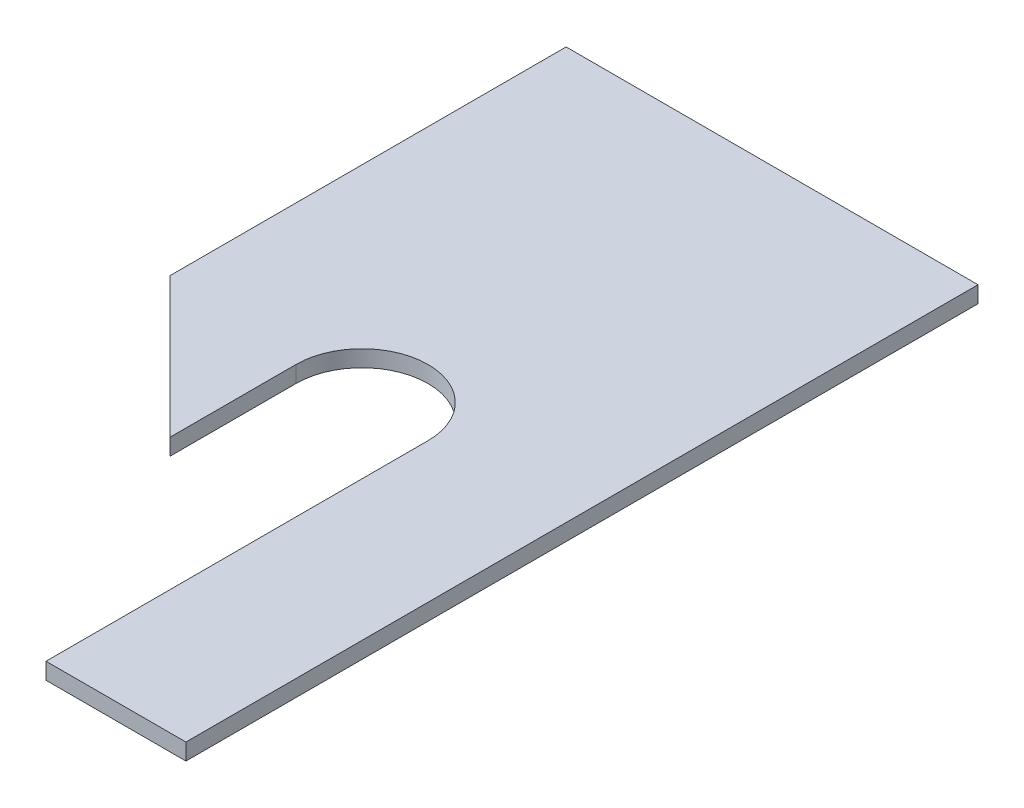
ISO-10303-21;
HEADER;
FILE_DESCRIPTION(('STEP AP214'),'2;1');
FILE_NAME('part.step','',(''),(''),'','','');
FILE_SCHEMA(('AUTOMOTIVE_DESIGN { 1 0 10303 214 1 1 1 1 }'));
ENDSEC;
DATA;
#1=APPLICATION_CONTEXT('core data for automotive mechanical design processes');
#2=APPLICATION_PROTOCOL_DEFINITION('international standard','automotive_design',2000,#1);
#3=PRODUCT_CONTEXT('',#1,'mechanical');
#4=PRODUCT('Part','Part','',(#3));
#5=PRODUCT_RELATED_PRODUCT_CATEGORY('part','',(#4));
#6=PRODUCT_DEFINITION_FORMATION('','',#4);
#7=PRODUCT_DEFINITION_CONTEXT('part definition',#1,'design');
#8=PRODUCT_DEFINITION('design','',#6,#7);
#9=PRODUCT_DEFINITION_SHAPE('','',#8);
#10=(LENGTH_UNIT() NAMED_UNIT(*) SI_UNIT(.MILLI.,.METRE.));
#11=(NAMED_UNIT(*) PLANE_ANGLE_UNIT() SI_UNIT($,.RADIAN.));
#12=(NAMED_UNIT(*) SI_UNIT($,.STERADIAN.) SOLID_ANGLE_UNIT());
#13=UNCERTAINTY_MEASURE_WITH_UNIT(LENGTH_MEASURE(1.E-05),#10,'distance_accuracy_value','');
#14=(GEOMETRIC_REPRESENTATION_CONTEXT(3) GLOBAL_UNCERTAINTY_ASSIGNED_CONTEXT((#13)) GLOBAL_UNIT_ASSIGNED_CONTEXT((#10,
#11,#12)) REPRESENTATION_CONTEXT('',''));
#15=CARTESIAN_POINT('',(0.,0.,0.));
#16=DIRECTION('',(0.,0.,1.));
#17=DIRECTION('',(1.,0.,0.));
#18=AXIS2_PLACEMENT_3D('',#15,#16,#17);
#19=CARTESIAN_POINT('',(19.812,-3.175,6.35));
#20=DIRECTION('',(1.,0.,0.));
#21=DIRECTION('',(0.,0.,-1.));
#22=AXIS2_PLACEMENT_3D('',#19,#20,#21);
#23=CYLINDRICAL_SURFACE('',#22,3.175);
#24=CARTESIAN_POINT('',(-11.90625,-3.175,3.175));
#25=CARTESIAN_POINT('',(-11.9062422889978,-3.29123774952783,3.17500738832153));
#26=CARTESIAN_POINT('',(-11.8976694959964,-3.40766564073322,3.18145090112497));
#27=CARTESIAN_POINT('',(-11.8639160647154,-3.6368615744445,3.20664508549818));
#28=CARTESIAN_POINT('',(-11.8386936724563,-3.74961966588074,3.22542669806605));
#29=CARTESIAN_POINT('',(-11.7733557491061,-3.96753495773282,3.27349366642535));
#30=CARTESIAN_POINT('',(-11.7333307452189,-4.07273381121699,3.30271513978643));
#31=CARTESIAN_POINT('',(-11.6402765305923,-4.2742204608747,3.36945991033653));
#32=CARTESIAN_POINT('',(-11.587251124023,-4.37051085250455,3.40698077864798));
#33=CARTESIAN_POINT('',(-11.464507468493,-4.56162717493788,3.49171348088459));
#34=CARTESIAN_POINT('',(-11.3936981145185,-4.65549175120323,3.53950097693389));
#35=CARTESIAN_POINT('',(-11.240300358353,-4.83080562895331,3.63907359096079));
#36=CARTESIAN_POINT('',(-11.1576937711029,-4.91223535389901,3.69086482296125));
#37=CARTESIAN_POINT('',(-10.9639370616133,-5.07741493771324,3.80569591207379));
#38=CARTESIAN_POINT('',(-10.8503979125542,-5.15827293241202,3.86888267903683));
#39=CARTESIAN_POINT('',(-10.6085465178832,-5.30005922107409,3.9892058159439));
#40=CARTESIAN_POINT('',(-10.4802547935153,-5.36101475711164,4.04635038321886));
#41=CARTESIAN_POINT('',(-10.2560392435993,-5.44322996650867,4.1278626615165));
#42=CARTESIAN_POINT('',(-10.1641422683081,-5.47093258199663,4.15674569991109));
#43=CARTESIAN_POINT('',(-9.97522653352951,-5.51530317696783,4.20415094285738));
#44=CARTESIAN_POINT('',(-9.87822005512393,-5.53199641876511,4.22269685191541));
#45=CARTESIAN_POINT('',(-9.68028514546976,-5.5532785514952,4.24650281500786));
#46=CARTESIAN_POINT('',(-9.57932931932552,-5.55775740831047,4.25164207650905));
#47=CARTESIAN_POINT('',(-9.37797382897555,-5.55384038521473,4.24720493305488));
#48=CARTESIAN_POINT('',(-9.27757437711122,-5.54543988949792,4.23762325228746));
#49=CARTESIAN_POINT('',(-9.09130873596155,-5.51811411125863,4.20738898070751));
#50=CARTESIAN_POINT('',(-9.00503601096416,-5.50040947129551,4.1880288816745));
#51=CARTESIAN_POINT('',(-8.83691578003065,-5.45632752904159,4.14156218858664));
#52=CARTESIAN_POINT('',(-8.75507261583017,-5.42994189093843,4.11444815220298));
#53=CARTESIAN_POINT('',(-8.5466929862181,-5.35039989373928,4.0363494124526));
#54=CARTESIAN_POINT('',(-8.42422683857752,-5.29082235734334,3.98104281991326));
#55=CARTESIAN_POINT('',(-8.19277551835875,-5.15331112011659,3.86503389194644));
#56=CARTESIAN_POINT('',(-8.08382409893671,-5.07533281755673,3.80431867268843));
#57=CARTESIAN_POINT('',(-7.87756649273064,-4.89984421512689,3.68217970202327));
#58=CARTESIAN_POINT('',(-7.78062228656218,-4.80189183649656,3.62077656063647));
#59=CARTESIAN_POINT('',(-7.60370646074835,-4.58854575319329,3.504437397073));
#60=CARTESIAN_POINT('',(-7.52370237668445,-4.47318614861414,3.44948909639096));
#61=CARTESIAN_POINT('',(-7.39778048116587,-4.25116955278269,3.36105934851844));
#62=CARTESIAN_POINT('',(-7.34824445654671,-4.1474070441286,3.32548276103652));
#63=CARTESIAN_POINT('',(-7.26404300239928,-3.93120907474954,3.26433014259229));
#64=CARTESIAN_POINT('',(-7.2293682593848,-3.81877909816551,3.23874784915111));
#65=CARTESIAN_POINT('',(-7.17668528591231,-3.58723601984555,3.1996762796162));
#66=CARTESIAN_POINT('',(-7.15878016404419,-3.46808628714193,3.1862618336279));
#67=CARTESIAN_POINT('',(-7.14129001606236,-3.22770696526885,3.17316034985065));
#68=CARTESIAN_POINT('',(-7.14169726049924,-3.10647827520302,3.17346752031719));
#69=CARTESIAN_POINT('',(-7.15980099862729,-2.87844831475295,3.18702455369988));
#70=CARTESIAN_POINT('',(-7.17575482973999,-2.77142208975862,3.19896984005571));
#71=CARTESIAN_POINT('',(-7.22149589833807,-2.56204927566255,3.23292282697019));
#72=CARTESIAN_POINT('',(-7.25128607934728,-2.45970368740387,3.25493266863144));
#73=CARTESIAN_POINT('',(-7.32454636788784,-2.25835099603219,3.30835255247656));
#74=CARTESIAN_POINT('',(-7.36846217086249,-2.15958919595996,3.34006693807746));
#75=CARTESIAN_POINT('',(-7.46787410268725,-1.97085133088783,3.41047462022189));
#76=CARTESIAN_POINT('',(-7.5233718335631,-1.88087648383952,3.44916888212948));
#77=CARTESIAN_POINT('',(-7.65457946600812,-1.69622750589673,3.53823130343926));
#78=CARTESIAN_POINT('',(-7.73211702451384,-1.60327791289923,3.58946985897001));
#79=CARTESIAN_POINT('',(-7.89941968956511,-1.43077348049052,3.69509065085416));
#80=CARTESIAN_POINT('',(-7.98921187198676,-1.35124919916581,3.74947969040796));
#81=CARTESIAN_POINT('',(-8.14135867762719,-1.23568014727309,3.83552984273079));
#82=CARTESIAN_POINT('',(-8.20011842432266,-1.19506041250094,3.8674845242569));
#83=CARTESIAN_POINT('',(-8.32153746131706,-1.11899083932021,3.930106097604));
#84=CARTESIAN_POINT('',(-8.38419817234931,-1.08354290038425,3.96077251334711));
#85=CARTESIAN_POINT('',(-8.57772514702997,-0.985512117393265,4.04903991166232));
#86=CARTESIAN_POINT('',(-8.71459858920488,-0.930887236326167,4.10318796138124));
#87=CARTESIAN_POINT('',(-8.9462342137088,-0.86334472180501,4.17324137950198));
#88=CARTESIAN_POINT('',(-9.03667460214931,-0.842468754109672,4.19582994116718));
#89=CARTESIAN_POINT('',(-9.22131875637091,-0.811348551938333,4.23001890762115));
#90=CARTESIAN_POINT('',(-9.31551363011133,-0.801080586191723,4.24164383416924));
#91=CARTESIAN_POINT('',(-9.5056796611505,-0.791918902243315,4.25199832679163));
#92=CARTESIAN_POINT('',(-9.6016573893939,-0.793082926460563,4.25066242879037));
#93=CARTESIAN_POINT('',(-9.79178995129163,-0.806817049422752,4.2351888171247));
#94=CARTESIAN_POINT('',(-9.88594227242896,-0.819401867041382,4.22103458351314));
#95=CARTESIAN_POINT('',(-10.0900145308797,-0.858935344953832,4.1780245795957));
#96=CARTESIAN_POINT('',(-10.1988895175399,-0.888419974971033,4.14663391408929));
#97=CARTESIAN_POINT('',(-10.4084988278193,-0.960919174660026,4.07379558552839));
#98=CARTESIAN_POINT('',(-10.509211771218,-1.00396792095367,4.03232257962974));
#99=CARTESIAN_POINT('',(-10.7355026195185,-1.11920720513196,3.92880023621188));
#100=CARTESIAN_POINT('',(-10.8575865692866,-1.19632656353304,3.86460378800867));
#101=CARTESIAN_POINT('',(-11.0857077854426,-1.3707837906493,3.73517601487474));
#102=CARTESIAN_POINT('',(-11.1917306078706,-1.46813967387988,3.66994381603552));
#103=CARTESIAN_POINT('',(-11.3868888307874,-1.68338393759943,3.54441593378731));
#104=CARTESIAN_POINT('',(-11.4758779422755,-1.80143483260463,3.48416533635787));
#105=CARTESIAN_POINT('',(-11.5930023182894,-1.99208845589539,3.40277462925502));
#106=CARTESIAN_POINT('',(-11.6293056515864,-2.05787268873465,3.3771506224806));
#107=CARTESIAN_POINT('',(-11.6959479856408,-2.19364867395731,3.32961257125289));
#108=CARTESIAN_POINT('',(-11.7262900645194,-2.26363823039306,3.30769661294754));
#109=CARTESIAN_POINT('',(-11.7916042882745,-2.43702165316802,3.26016572561181));
#110=CARTESIAN_POINT('',(-11.8233226487517,-2.54228469176272,3.23675466691393));
#111=CARTESIAN_POINT('',(-11.8719954379304,-2.75775035612656,3.20065210833702));
#112=CARTESIAN_POINT('',(-11.8889910995913,-2.86793827171599,3.18793067370395));
#113=CARTESIAN_POINT('',(-11.900859690726,-3.0115453205779,3.17904086083894));
#114=CARTESIAN_POINT('',(-11.9028785178754,-3.04417885510127,3.17752797457549));
#115=CARTESIAN_POINT('',(-11.905574866405,-3.10953655587336,3.17550642283789));
#116=CARTESIAN_POINT('',(-11.9062521718636,-3.14226073586306,3.17499791902191));
#117=CARTESIAN_POINT('',(-11.90625,-3.175,3.175));
#118=B_SPLINE_CURVE_WITH_KNOTS('',3,(#24,#25,#26,#27,#28,#29,#30,#31,#32,#33,#34,#35,#36,#37,
#38,#39,#40,#41,#42,#43,#44,#45,#46,#47,#48,#49,#50,#51,#52,#53,#54,#55,#56,#57,#58,#59,#60,#61,
#62,#63,#64,#65,#66,#67,#68,#69,#70,#71,#72,#73,#74,#75,#76,#77,#78,#79,#80,#81,#82,#83,#84,#85,
#86,#87,#88,#89,#90,#91,#92,#93,#94,#95,#96,#97,#98,#99,#100,#101,#102,#103,#104,#105,#106,#107,
#108,#109,#110,#111,#112,#113,#114,#115,#116,#117),.UNSPECIFIED.,.T.,.F.,(4,2,2,2,2,2,2,2,2,2,2,
2,2,2,2,2,2,2,2,2,2,2,2,2,2,2,2,2,2,2,2,2,2,2,2,2,2,2,2,2,2,2,2,2,2,2,4),(0.,0.348570211183117,
0.698017907084399,1.04536292954774,1.39260643317325,1.7720060971642,2.15199703593195,
2.60921525221329,3.06580498814704,3.36549235666219,3.66448964197523,3.96617170348745,
4.26796190951582,4.53750188133299,4.80730143441015,5.24588314241881,5.68553905368148,
6.13625715751718,6.58610351708733,6.94573326697642,7.30513730808448,7.66673692339951,
8.02818391290748,8.3532850938154,8.67845546794976,9.01510197680341,9.35179508189345,
9.74471606554964,10.138519680144,10.3730162315183,10.6075986920301,11.0748475643975,
11.360400167866,11.645312566215,11.931664780221,12.2183865637281,12.5677020067691,
12.9179047318732,13.3895916459373,13.8617002669824,14.3376974909728,14.5755004982781,
14.8131803903096,15.1489124669465,15.4837012109698,15.5818629176727,15.6800404224897),.UNSPECIFIED.);
#119=CARTESIAN_POINT('',(-7.14375,-3.175,3.175));
#120=VERTEX_POINT('',#119);
#121=CARTESIAN_POINT('',(-11.90625,-3.175,3.175));
#122=VERTEX_POINT('',#121);
#123=EDGE_CURVE('E151',#120,#122,#118,.T.);
#124=ORIENTED_EDGE('',*,*,#123,.F.);
#125=DIRECTION('',(-1.,0.,0.));
#126=VECTOR('',#125,1.);
#127=CARTESIAN_POINT('',(-12.7,-3.175,3.175));
#128=LINE('',#127,#126);
#129=CARTESIAN_POINT('',(7.14375,-3.175,3.175));
#130=VERTEX_POINT('',#129);
#131=EDGE_CURVE('E159',#130,#120,#128,.T.);
#132=ORIENTED_EDGE('',*,*,#131,.F.);
#133=CARTESIAN_POINT('',(7.14375,-3.175,3.175));
#134=CARTESIAN_POINT('',(7.14375771100222,-3.29123774952783,3.17500738832153));
#135=CARTESIAN_POINT('',(7.15233050400356,-3.40766564073322,3.18145090112497));
#136=CARTESIAN_POINT('',(7.18608393528457,-3.6368615744445,3.20664508549818));
#137=CARTESIAN_POINT('',(7.21130632754369,-3.74961966588074,3.22542669806605));
#138=CARTESIAN_POINT('',(7.27664425089392,-3.96753495773282,3.27349366642535));
#139=CARTESIAN_POINT('',(7.31666925478113,-4.07273381121698,3.30271513978643));
#140=CARTESIAN_POINT('',(7.40972346940774,-4.2742204608747,3.36945991033653));
#141=CARTESIAN_POINT('',(7.46274887597704,-4.37051085250454,3.40698077864798));
#142=CARTESIAN_POINT('',(7.585492531507,-4.56162717493788,3.49171348088459));
#143=CARTESIAN_POINT('',(7.65630188548147,-4.65549175120323,3.53950097693389));
#144=CARTESIAN_POINT('',(7.80969964164697,-4.83080562895331,3.63907359096079));
#145=CARTESIAN_POINT('',(7.89230622889713,-4.912235353899,3.69086482296125));
#146=CARTESIAN_POINT('',(8.08606293838669,-5.07741493771324,3.80569591207379));
#147=CARTESIAN_POINT('',(8.19960208744583,-5.15827293241202,3.86888267903683));
#148=CARTESIAN_POINT('',(8.44145348211678,-5.30005922107409,3.9892058159439));
#149=CARTESIAN_POINT('',(8.56974520648473,-5.36101475711164,4.04635038321886));
#150=CARTESIAN_POINT('',(8.79396075640066,-5.44322996650867,4.1278626615165));
#151=CARTESIAN_POINT('',(8.88585773169188,-5.47093258199663,4.1567456999111));
#152=CARTESIAN_POINT('',(9.07477346647049,-5.51530317696783,4.20415094285738));
#153=CARTESIAN_POINT('',(9.17177994487608,-5.53199641876511,4.22269685191542));
#154=CARTESIAN_POINT('',(9.36971485453025,-5.5532785514952,4.24650281500786));
#155=CARTESIAN_POINT('',(9.47067068067448,-5.55775740831047,4.25164207650905));
#156=CARTESIAN_POINT('',(9.67202617102445,-5.55384038521473,4.24720493305489));
#157=CARTESIAN_POINT('',(9.77242562288879,-5.54543988949792,4.23762325228746));
#158=CARTESIAN_POINT('',(9.95869126403846,-5.51811411125863,4.20738898070751));
#159=CARTESIAN_POINT('',(10.0449639890358,-5.50040947129551,4.1880288816745));
#160=CARTESIAN_POINT('',(10.2130842199694,-5.45632752904159,4.14156218858664));
#161=CARTESIAN_POINT('',(10.2949273841698,-5.42994189093843,4.11444815220298));
#162=CARTESIAN_POINT('',(10.5033070137819,-5.35039989373928,4.0363494124526));
#163=CARTESIAN_POINT('',(10.6257731614225,-5.29082235734334,3.98104281991326));
#164=CARTESIAN_POINT('',(10.8572244816412,-5.15331112011659,3.86503389194644));
#165=CARTESIAN_POINT('',(10.9661759010633,-5.07533281755673,3.80431867268843));
#166=CARTESIAN_POINT('',(11.1724335072694,-4.89984421512689,3.68217970202328));
#167=CARTESIAN_POINT('',(11.2693777134378,-4.80189183649656,3.62077656063647));
#168=CARTESIAN_POINT('',(11.4462935392517,-4.58854575319329,3.50443739707301));
#169=CARTESIAN_POINT('',(11.5262976233156,-4.47318614861414,3.44948909639096));
#170=CARTESIAN_POINT('',(11.6522195188341,-4.25116955278268,3.36105934851844));
#171=CARTESIAN_POINT('',(11.7017555434533,-4.14740704412859,3.32548276103652));
#172=CARTESIAN_POINT('',(11.7859569976007,-3.93120907474953,3.2643301425923));
#173=CARTESIAN_POINT('',(11.8206317406152,-3.8187790981655,3.23874784915111));
#174=CARTESIAN_POINT('',(11.8733147140877,-3.58723601984555,3.1996762796162));
#175=CARTESIAN_POINT('',(11.8912198359558,-3.46808628714193,3.1862618336279));
#176=CARTESIAN_POINT('',(11.9087099839376,-3.22770696526885,3.17316034985065));
#177=CARTESIAN_POINT('',(11.9083027395008,-3.10647827520301,3.17346752031719));
#178=CARTESIAN_POINT('',(11.8901990013727,-2.87844831475295,3.18702455369988));
#179=CARTESIAN_POINT('',(11.87424517026,-2.77142208975861,3.19896984005572));
#180=CARTESIAN_POINT('',(11.8285041016619,-2.56204927566254,3.23292282697019));
#181=CARTESIAN_POINT('',(11.7987139206527,-2.45970368740387,3.25493266863145));
#182=CARTESIAN_POINT('',(11.7254536321122,-2.25835099603219,3.30835255247656));
#183=CARTESIAN_POINT('',(11.6815378291375,-2.15958919595996,3.34006693807746));
#184=CARTESIAN_POINT('',(11.5821258973127,-1.97085133088782,3.41047462022189));
#185=CARTESIAN_POINT('',(11.5266281664369,-1.88087648383951,3.44916888212949));
#186=CARTESIAN_POINT('',(11.3954205339919,-1.69622750589672,3.53823130343927));
#187=CARTESIAN_POINT('',(11.3178829754862,-1.60327791289923,3.58946985897001));
#188=CARTESIAN_POINT('',(11.1505803104349,-1.43077348049051,3.69509065085416));
#189=CARTESIAN_POINT('',(11.0607881280132,-1.35124919916581,3.74947969040796));
#190=CARTESIAN_POINT('',(10.9086413223728,-1.23568014727309,3.8355298427308));
#191=CARTESIAN_POINT('',(10.8498815756773,-1.19506041250093,3.8674845242569));
#192=CARTESIAN_POINT('',(10.7284625386829,-1.11899083932021,3.93010609760401));
#193=CARTESIAN_POINT('',(10.6658018276507,-1.08354290038424,3.96077251334711));
#194=CARTESIAN_POINT('',(10.47227485297,-0.985512117393262,4.04903991166233));
#195=CARTESIAN_POINT('',(10.3354014107951,-0.930887236326165,4.10318796138125));
#196=CARTESIAN_POINT('',(10.1037657862912,-0.863344721805008,4.17324137950198));
#197=CARTESIAN_POINT('',(10.0133253978507,-0.842468754109671,4.19582994116718));
#198=CARTESIAN_POINT('',(9.82868124362909,-0.811348551938332,4.23001890762115));
#199=CARTESIAN_POINT('',(9.73448636988866,-0.801080586191721,4.24164383416924));
#200=CARTESIAN_POINT('',(9.54432033884949,-0.791918902243314,4.25199832679164));
#201=CARTESIAN_POINT('',(9.4483426106061,-0.793082926460562,4.25066242879037));
#202=CARTESIAN_POINT('',(9.25821004870836,-0.806817049422752,4.2351888171247));
#203=CARTESIAN_POINT('',(9.16405772757103,-0.819401867041384,4.22103458351314));
#204=CARTESIAN_POINT('',(8.95998546912029,-0.858935344953835,4.1780245795957));
#205=CARTESIAN_POINT('',(8.85111048246013,-0.888419974971036,4.14663391408929));
#206=CARTESIAN_POINT('',(8.64150117218066,-0.96091917466003,4.07379558552839));
#207=CARTESIAN_POINT('',(8.54078822878196,-1.00396792095368,4.03232257962973));
#208=CARTESIAN_POINT('',(8.31449738048151,-1.11920720513196,3.92880023621188));
#209=CARTESIAN_POINT('',(8.19241343071334,-1.19632656353305,3.86460378800866));
#210=CARTESIAN_POINT('',(7.96429221455737,-1.37078379064931,3.73517601487474));
#211=CARTESIAN_POINT('',(7.85826939212943,-1.46813967387989,3.66994381603552));
#212=CARTESIAN_POINT('',(7.66311116921256,-1.68338393759944,3.5444159337873));
#213=CARTESIAN_POINT('',(7.57412205772446,-1.80143483260464,3.48416533635786));
#214=CARTESIAN_POINT('',(7.45699768171056,-1.9920884558954,3.40277462925501));
#215=CARTESIAN_POINT('',(7.42069434841361,-2.05787268873466,3.3771506224806));
#216=CARTESIAN_POINT('',(7.35405201435923,-2.19364867395733,3.32961257125289));
#217=CARTESIAN_POINT('',(7.32370993548056,-2.26363823039308,3.30769661294754));
#218=CARTESIAN_POINT('',(7.25839571172553,-2.43702165316804,3.26016572561181));
#219=CARTESIAN_POINT('',(7.22667735124828,-2.54228469176274,3.23675466691393));
#220=CARTESIAN_POINT('',(7.17800456206957,-2.75775035612657,3.20065210833702));
#221=CARTESIAN_POINT('',(7.16100890040872,-2.867938271716,3.18793067370396));
#222=CARTESIAN_POINT('',(7.14914030927397,-3.01154532057791,3.17904086083894));
#223=CARTESIAN_POINT('',(7.14712148212465,-3.04417885510128,3.17752797457549));
#224=CARTESIAN_POINT('',(7.14442513359505,-3.10953655587336,3.17550642283789));
#225=CARTESIAN_POINT('',(7.14374782813639,-3.14226073586307,3.17499791902191));
#226=CARTESIAN_POINT('',(7.14375,-3.175,3.175));
#227=B_SPLINE_CURVE_WITH_KNOTS('',3,(#133,#134,#135,#136,#137,#138,#139,#140,#141,#142,#143,
#144,#145,#146,#147,#148,#149,#150,#151,#152,#153,#154,#155,#156,#157,#158,#159,#160,#161,#162,
#163,#164,#165,#166,#167,#168,#169,#170,#171,#172,#173,#174,#175,#176,#177,#178,#179,#180,#181,
#182,#183,#184,#185,#186,#187,#188,#189,#190,#191,#192,#193,#194,#195,#196,#197,#198,#199,#200,
#201,#202,#203,#204,#205,#206,#207,#208,#209,#210,#211,#212,#213,#214,#215,#216,#217,#218,#219,
#220,#221,#222,#223,#224,#225,#226),.UNSPECIFIED.,.T.,.F.,(4,2,2,2,2,2,2,2,2,2,2,2,2,2,2,2,2,2,
2,2,2,2,2,2,2,2,2,2,2,2,2,2,2,2,2,2,2,2,2,2,2,2,2,2,2,2,4),(0.,0.348570211183117,
0.698017907084399,1.04536292954774,1.39260643317325,1.77200609716419,2.15199703593195,
2.60921525221329,3.06580498814704,3.36549235666219,3.66448964197523,3.96617170348745,
4.26796190951583,4.537501881333,4.80730143441015,5.24588314241881,5.68553905368149,
6.13625715751718,6.58610351708734,6.94573326697642,7.30513730808448,7.66673692339951,
8.02818391290749,8.3532850938154,8.67845546794977,9.01510197680341,9.35179508189346,
9.74471606554965,10.138519680144,10.3730162315183,10.6075986920301,11.0748475643975,
11.360400167866,11.645312566215,11.931664780221,12.2183865637282,12.5677020067691,
12.9179047318732,13.3895916459373,13.8617002669824,14.3376974909728,14.5755004982781,
14.8131803903096,15.1489124669465,15.4837012109698,15.5818629176727,15.6800404224897),.UNSPECIFIED.);
#228=CARTESIAN_POINT('',(11.90625,-3.175,3.175));
#229=VERTEX_POINT('',#228);
#230=EDGE_CURVE('E11',#229,#130,#227,.T.);
#231=ORIENTED_EDGE('',*,*,#230,.F.);
#232=CARTESIAN_POINT('',(12.7,-3.175,3.175));
#233=VERTEX_POINT('',#232);
#234=EDGE_CURVE('E168',#233,#229,#128,.T.);
#235=ORIENTED_EDGE('',*,*,#234,.F.);
#236=CARTESIAN_POINT('',(15.875,-3.175,6.35));
#237=DIRECTION('',(0.707106781186548,0.,-0.707106781186547));
#238=DIRECTION('',(0.707106781186547,0.,0.707106781186547));
#239=AXIS2_PLACEMENT_3D('',#236,#237,#238);
#240=ELLIPSE('',#239,4.49012806053458,3.175);
#241=CARTESIAN_POINT('',(15.875,0.,6.35));
#242=VERTEX_POINT('',#241);
#243=EDGE_CURVE('E178',#233,#242,#240,.T.);
#244=ORIENTED_EDGE('',*,*,#243,.T.);
#245=DIRECTION('',(-1.,0.,0.));
#246=VECTOR('',#245,1.);
#247=CARTESIAN_POINT('',(12.7,0.,6.35));
#248=LINE('',#247,#246);
#249=CARTESIAN_POINT('',(-15.875,0.,6.35));
#250=VERTEX_POINT('',#249);
#251=EDGE_CURVE('E277',#250,#242,#248,.F.);
#252=ORIENTED_EDGE('',*,*,#251,.F.);
#253=CARTESIAN_POINT('',(-15.875,-3.175,6.34999999999999));
#254=DIRECTION('',(0.707106781186547,0.,0.707106781186547));
#255=DIRECTION('',(0.707106781186548,0.,-0.707106781186547));
#256=AXIS2_PLACEMENT_3D('',#253,#254,#255);
#257=ELLIPSE('',#256,4.49012806053458,3.175);
#258=CARTESIAN_POINT('',(-12.7,-3.175,3.175));
#259=VERTEX_POINT('',#258);
#260=EDGE_CURVE('E176',#259,#250,#257,.T.);
#261=ORIENTED_EDGE('',*,*,#260,.F.);
#262=EDGE_CURVE('E161',#122,#259,#128,.T.);
#263=ORIENTED_EDGE('',*,*,#262,.F.);
#264=EDGE_LOOP('',(#124,#132,#231,#235,#244,#252,#261,#263));
#265=FACE_BOUND('',#264,.T.);
#266=ADVANCED_FACE('F33',(#265),#23,.F.);
#267=CARTESIAN_POINT('',(-9.525,-3.175,0.));
#268=DIRECTION('',(0.,0.,-1.));
#269=DIRECTION('',(-1.,0.,0.));
#270=AXIS2_PLACEMENT_3D('',#267,#268,#269);
#271=CYLINDRICAL_SURFACE('',#270,1.47319999999999);
#272=CARTESIAN_POINT('',(-9.525,-3.175,0.));
#273=DIRECTION('',(0.,0.,-1.));
#274=DIRECTION('',(-1.,0.,0.));
#275=AXIS2_PLACEMENT_3D('',#272,#273,#274);
#276=CIRCLE('',#275,1.47319999999999);
#277=CARTESIAN_POINT('',(-10.9982,-3.175,0.));
#278=VERTEX_POINT('',#277);
#279=EDGE_CURVE('E311',#278,#278,#276,.T.);
#280=ORIENTED_EDGE('',*,*,#279,.T.);
#281=EDGE_LOOP('',(#280));
#282=FACE_BOUND('',#281,.T.);
#283=CARTESIAN_POINT('',(-9.525,-3.175,3.175));
#284=DIRECTION('',(0.,0.,-1.));
#285=DIRECTION('',(-1.,0.,0.));
#286=AXIS2_PLACEMENT_3D('',#283,#284,#285);
#287=CIRCLE('',#286,1.47319999999999);
#288=CARTESIAN_POINT('',(-10.9982,-3.175,3.175));
#289=VERTEX_POINT('',#288);
#290=EDGE_CURVE('E179',#289,#289,#287,.T.);
#291=ORIENTED_EDGE('',*,*,#290,.F.);
#292=EDGE_LOOP('',(#291));
#293=FACE_BOUND('',#292,.T.);
#294=ADVANCED_FACE('F319',(#282,#293),#271,.F.);
#295=CARTESIAN_POINT('',(9.525,-3.175,0.));
#296=DIRECTION('',(0.,0.,-1.));
#297=DIRECTION('',(-1.,0.,0.));
#298=AXIS2_PLACEMENT_3D('',#295,#296,#297);
#299=CYLINDRICAL_SURFACE('',#298,1.47319999999999);
#300=CARTESIAN_POINT('',(9.525,-3.175,0.));
#301=DIRECTION('',(0.,0.,-1.));
#302=DIRECTION('',(-1.,0.,0.));
#303=AXIS2_PLACEMENT_3D('',#300,#301,#302);
#304=CIRCLE('',#303,1.47319999999999);
#305=CARTESIAN_POINT('',(8.05180000000001,-3.175,0.));
#306=VERTEX_POINT('',#305);
#307=EDGE_CURVE('E301',#306,#306,#304,.T.);
#308=ORIENTED_EDGE('',*,*,#307,.T.);
#309=EDGE_LOOP('',(#308));
#310=FACE_BOUND('',#309,.T.);
#311=CARTESIAN_POINT('',(9.525,-3.175,3.175));
#312=DIRECTION('',(0.,0.,-1.));
#313=DIRECTION('',(-1.,0.,0.));
#314=AXIS2_PLACEMENT_3D('',#311,#312,#313);
#315=CIRCLE('',#314,1.47319999999999);
#316=CARTESIAN_POINT('',(8.05180000000002,-3.175,3.175));
#317=VERTEX_POINT('',#316);
#318=EDGE_CURVE('E304',#317,#317,#315,.T.);
#319=ORIENTED_EDGE('',*,*,#318,.F.);
#320=EDGE_LOOP('',(#319));
#321=FACE_BOUND('',#320,.T.);
#322=ADVANCED_FACE('F321',(#310,#321),#299,.F.);
#323=CARTESIAN_POINT('',(0.,0.,0.));
#324=DIRECTION('',(0.,1.,0.));
#325=DIRECTION('',(0.,0.,1.));
#326=AXIS2_PLACEMENT_3D('',#323,#324,#325);
#327=PLANE('',#326);
#328=DIRECTION('',(1.,0.,0.));
#329=VECTOR('',#328,1.);
#330=CARTESIAN_POINT('',(-19.812,0.,0.));
#331=LINE('',#330,#329);
#332=CARTESIAN_POINT('',(-19.812,0.,0.));
#333=VERTEX_POINT('',#332);
#334=CARTESIAN_POINT('',(-15.875,0.,0.));
#335=VERTEX_POINT('',#334);
#336=EDGE_CURVE('E181',#333,#335,#331,.T.);
#337=ORIENTED_EDGE('',*,*,#336,.T.);
#338=DIRECTION('',(0.,0.,-1.));
#339=VECTOR('',#338,1.);
#340=CARTESIAN_POINT('',(-15.875,0.,3.17500000000003));
#341=LINE('',#340,#339);
#342=EDGE_CURVE('E280',#335,#250,#341,.F.);
#343=ORIENTED_EDGE('',*,*,#342,.T.);
#344=ORIENTED_EDGE('',*,*,#251,.T.);
#345=DIRECTION('',(0.,0.,-1.));
#346=VECTOR('',#345,1.);
#347=CARTESIAN_POINT('',(15.875,0.,0.));
#348=LINE('',#347,#346);
#349=CARTESIAN_POINT('',(15.875,0.,0.));
#350=VERTEX_POINT('',#349);
#351=EDGE_CURVE('E279',#242,#350,#348,.T.);
#352=ORIENTED_EDGE('',*,*,#351,.T.);
#353=DIRECTION('',(1.,0.,0.));
#354=VECTOR('',#353,1.);
#355=CARTESIAN_POINT('',(19.812,0.,0.));
#356=LINE('',#355,#354);
#357=CARTESIAN_POINT('',(19.812,0.,0.));
#358=VERTEX_POINT('',#357);
#359=EDGE_CURVE('E199',#350,#358,#356,.T.);
#360=ORIENTED_EDGE('',*,*,#359,.T.);
#361=DIRECTION('',(0.,0.,-1.));
#362=VECTOR('',#361,1.);
#363=CARTESIAN_POINT('',(19.812,0.,0.));
#364=LINE('',#363,#362);
#365=CARTESIAN_POINT('',(19.812,0.,76.2));
#366=VERTEX_POINT('',#365);
#367=EDGE_CURVE('E247',#366,#358,#364,.T.);
#368=ORIENTED_EDGE('',*,*,#367,.F.);
#369=DIRECTION('',(-1.,0.,0.));
#370=VECTOR('',#369,1.);
#371=CARTESIAN_POINT('',(19.812,0.,76.2));
#372=LINE('',#371,#370);
#373=CARTESIAN_POINT('',(6.35,0.,76.2));
#374=VERTEX_POINT('',#373);
#375=EDGE_CURVE('E204',#366,#374,#372,.T.);
#376=ORIENTED_EDGE('',*,*,#375,.T.);
#377=DIRECTION('',(0.,0.,-1.));
#378=VECTOR('',#377,1.);
#379=CARTESIAN_POINT('',(6.35,0.,0.));
#380=LINE('',#379,#378);
#381=CARTESIAN_POINT('',(6.35,0.,39.4490062513201));
#382=VERTEX_POINT('',#381);
#383=EDGE_CURVE('E223',#374,#382,#380,.T.);
#384=ORIENTED_EDGE('',*,*,#383,.T.);
#385=CARTESIAN_POINT('',(0.,0.,39.4490062513201));
#386=DIRECTION('',(0.,1.,0.));
#387=DIRECTION('',(0.,0.,1.));
#388=AXIS2_PLACEMENT_3D('',#385,#386,#387);
#389=CIRCLE('',#388,6.35);
#390=CARTESIAN_POINT('',(-6.35,0.,39.4490062513201));
#391=VERTEX_POINT('',#390);
#392=EDGE_CURVE('E234',#382,#391,#389,.T.);
#393=ORIENTED_EDGE('',*,*,#392,.T.);
#394=DIRECTION('',(0.,0.,1.));
#395=VECTOR('',#394,1.);
#396=CARTESIAN_POINT('',(-6.35,0.,0.));
#397=LINE('',#396,#395);
#398=CARTESIAN_POINT('',(-6.35,0.,51.5619999999999));
#399=VERTEX_POINT('',#398);
#400=EDGE_CURVE('E220',#391,#399,#397,.T.);
#401=ORIENTED_EDGE('',*,*,#400,.T.);
#402=DIRECTION('',(-0.707106781186549,0.,-0.707106781186546));
#403=VECTOR('',#402,1.);
#404=CARTESIAN_POINT('',(-28.956,0.,28.9560000000001));
#405=LINE('',#404,#403);
#406=CARTESIAN_POINT('',(-19.812,0.,38.1));
#407=VERTEX_POINT('',#406);
#408=EDGE_CURVE('E229',#399,#407,#405,.T.);
#409=ORIENTED_EDGE('',*,*,#408,.T.);
#410=DIRECTION('',(0.,0.,1.));
#411=VECTOR('',#410,1.);
#412=CARTESIAN_POINT('',(-19.812,0.,0.));
#413=LINE('',#412,#411);
#414=EDGE_CURVE('E242',#333,#407,#413,.T.);
#415=ORIENTED_EDGE('',*,*,#414,.F.);
#416=EDGE_LOOP('',(#337,#343,#344,#352,#360,#368,#376,#384,#393,#401,#409,#415));
#417=FACE_BOUND('',#416,.T.);
#418=ADVANCED_FACE('F281',(#417),#327,.F.);
#419=CARTESIAN_POINT('',(-19.812,1.5875,0.));
#420=DIRECTION('',(1.,0.,0.));
#421=DIRECTION('',(0.,0.,-1.));
#422=AXIS2_PLACEMENT_3D('',#419,#420,#421);
#423=PLANE('',#422);
#424=DIRECTION('',(0.,-1.,0.));
#425=VECTOR('',#424,1.);
#426=CARTESIAN_POINT('',(-19.812,1.5875,0.));
#427=LINE('',#426,#425);
#428=CARTESIAN_POINT('',(-19.812,1.5875,0.));
#429=VERTEX_POINT('',#428);
#430=EDGE_CURVE('E251',#429,#333,#427,.T.);
#431=ORIENTED_EDGE('',*,*,#430,.T.);
#432=ORIENTED_EDGE('',*,*,#414,.T.);
#433=DIRECTION('',(0.,1.,0.));
#434=VECTOR('',#433,1.);
#435=CARTESIAN_POINT('',(-19.812,-6.35,38.1));
#436=LINE('',#435,#434);
#437=CARTESIAN_POINT('',(-19.812,1.5875,38.1));
#438=VERTEX_POINT('',#437);
#439=EDGE_CURVE('E226',#407,#438,#436,.T.);
#440=ORIENTED_EDGE('',*,*,#439,.T.);
#441=DIRECTION('',(0.,0.,1.));
#442=VECTOR('',#441,1.);
#443=CARTESIAN_POINT('',(-19.812,1.5875,0.));
#444=LINE('',#443,#442);
#445=EDGE_CURVE('E243',#429,#438,#444,.T.);
#446=ORIENTED_EDGE('',*,*,#445,.F.);
#447=EDGE_LOOP('',(#431,#432,#440,#446));
#448=FACE_BOUND('',#447,.T.);
#449=ADVANCED_FACE('F364',(#448),#423,.F.);
#450=CARTESIAN_POINT('',(19.812,1.5875,0.));
#451=DIRECTION('',(-1.,0.,0.));
#452=DIRECTION('',(0.,0.,1.));
#453=AXIS2_PLACEMENT_3D('',#450,#451,#452);
#454=PLANE('',#453);
#455=ORIENTED_EDGE('',*,*,#367,.T.);
#456=DIRECTION('',(0.,-1.,0.));
#457=VECTOR('',#456,1.);
#458=CARTESIAN_POINT('',(19.812,1.5875,0.));
#459=LINE('',#458,#457);
#460=CARTESIAN_POINT('',(19.812,1.5875,0.));
#461=VERTEX_POINT('',#460);
#462=EDGE_CURVE('E258',#461,#358,#459,.T.);
#463=ORIENTED_EDGE('',*,*,#462,.F.);
#464=DIRECTION('',(0.,0.,-1.));
#465=VECTOR('',#464,1.);
#466=CARTESIAN_POINT('',(19.812,1.5875,0.));
#467=LINE('',#466,#465);
#468=CARTESIAN_POINT('',(19.812,1.5875,76.2));
#469=VERTEX_POINT('',#468);
#470=EDGE_CURVE('E246',#469,#461,#467,.T.);
#471=ORIENTED_EDGE('',*,*,#470,.F.);
#472=DIRECTION('',(0.,1.,0.));
#473=VECTOR('',#472,1.);
#474=CARTESIAN_POINT('',(19.812,-18.507172771658,76.2));
#475=LINE('',#474,#473);
#476=EDGE_CURVE('E207',#366,#469,#475,.T.);
#477=ORIENTED_EDGE('',*,*,#476,.F.);
#478=EDGE_LOOP('',(#455,#463,#471,#477));
#479=FACE_BOUND('',#478,.T.);
#480=ADVANCED_FACE('F367',(#479),#454,.F.);
#481=CARTESIAN_POINT('',(-19.812,1.5875,0.));
#482=DIRECTION('',(0.,0.,1.));
#483=DIRECTION('',(1.,0.,0.));
#484=AXIS2_PLACEMENT_3D('',#481,#482,#483);
#485=PLANE('',#484);
#486=ORIENTED_EDGE('',*,*,#307,.F.);
#487=EDGE_LOOP('',(#486));
#488=FACE_BOUND('',#487,.T.);
#489=ORIENTED_EDGE('',*,*,#279,.F.);
#490=EDGE_LOOP('',(#489));
#491=FACE_BOUND('',#490,.T.);
#492=DIRECTION('',(1.,0.,0.));
#493=VECTOR('',#492,1.);
#494=CARTESIAN_POINT('',(19.812,-6.35,0.));
#495=LINE('',#494,#493);
#496=CARTESIAN_POINT('',(-12.7,-6.35,0.));
#497=VERTEX_POINT('',#496);
#498=CARTESIAN_POINT('',(12.7,-6.35,0.));
#499=VERTEX_POINT('',#498);
#500=EDGE_CURVE('E240',#497,#499,#495,.T.);
#501=ORIENTED_EDGE('',*,*,#500,.F.);
#502=DIRECTION('',(0.,-1.,0.));
#503=VECTOR('',#502,1.);
#504=CARTESIAN_POINT('',(-12.7,-6.35,0.));
#505=LINE('',#504,#503);
#506=CARTESIAN_POINT('',(-12.7,-3.175,0.));
#507=VERTEX_POINT('',#506);
#508=EDGE_CURVE('E186',#507,#497,#505,.T.);
#509=ORIENTED_EDGE('',*,*,#508,.F.);
#510=CARTESIAN_POINT('',(-15.875,-3.175,0.));
#511=DIRECTION('',(0.,0.,1.));
#512=DIRECTION('',(1.,0.,0.));
#513=AXIS2_PLACEMENT_3D('',#510,#511,#512);
#514=CIRCLE('',#513,3.175);
#515=EDGE_CURVE('E170',#507,#335,#514,.T.);
#516=ORIENTED_EDGE('',*,*,#515,.T.);
#517=ORIENTED_EDGE('',*,*,#336,.F.);
#518=ORIENTED_EDGE('',*,*,#430,.F.);
#519=DIRECTION('',(-1.,0.,0.));
#520=VECTOR('',#519,1.);
#521=CARTESIAN_POINT('',(-19.812,1.5875,0.));
#522=LINE('',#521,#520);
#523=EDGE_CURVE('E249',#461,#429,#522,.T.);
#524=ORIENTED_EDGE('',*,*,#523,.F.);
#525=ORIENTED_EDGE('',*,*,#462,.T.);
#526=ORIENTED_EDGE('',*,*,#359,.F.);
#527=CARTESIAN_POINT('',(15.875,-3.175,0.));
#528=DIRECTION('',(0.,0.,1.));
#529=DIRECTION('',(1.,0.,0.));
#530=AXIS2_PLACEMENT_3D('',#527,#528,#529);
#531=CIRCLE('',#530,3.175);
#532=CARTESIAN_POINT('',(12.7,-3.175,0.));
#533=VERTEX_POINT('',#532);
#534=EDGE_CURVE('E44',#350,#533,#531,.T.);
#535=ORIENTED_EDGE('',*,*,#534,.T.);
#536=DIRECTION('',(0.,1.,0.));
#537=VECTOR('',#536,1.);
#538=CARTESIAN_POINT('',(12.7,-6.35,0.));
#539=LINE('',#538,#537);
#540=EDGE_CURVE('E197',#499,#533,#539,.T.);
#541=ORIENTED_EDGE('',*,*,#540,.F.);
#542=EDGE_LOOP('',(#501,#509,#516,#517,#518,#524,#525,#526,#535,#541));
#543=FACE_BOUND('',#542,.T.);
#544=ADVANCED_FACE('F292',(#488,#491,#543),#485,.F.);
#545=CARTESIAN_POINT('',(0.,1.5875,0.));
#546=DIRECTION('',(0.,1.,0.));
#547=DIRECTION('',(0.,0.,1.));
#548=AXIS2_PLACEMENT_3D('',#545,#546,#547);
#549=PLANE('',#548);
#550=DIRECTION('',(0.,0.,1.));
#551=VECTOR('',#550,1.);
#552=CARTESIAN_POINT('',(-6.35,1.5875,39.4490062513201));
#553=LINE('',#552,#551);
#554=CARTESIAN_POINT('',(-6.35,1.5875,39.4490062513201));
#555=VERTEX_POINT('',#554);
#556=CARTESIAN_POINT('',(-6.35,1.5875,51.5619999999999));
#557=VERTEX_POINT('',#556);
#558=EDGE_CURVE('E206',#555,#557,#553,.T.);
#559=ORIENTED_EDGE('',*,*,#558,.F.);
#560=CARTESIAN_POINT('',(0.,1.5875,39.4490062513201));
#561=DIRECTION('',(0.,1.,0.));
#562=DIRECTION('',(0.,0.,1.));
#563=AXIS2_PLACEMENT_3D('',#560,#561,#562);
#564=CIRCLE('',#563,6.35);
#565=CARTESIAN_POINT('',(6.35,1.5875,39.4490062513201));
#566=VERTEX_POINT('',#565);
#567=EDGE_CURVE('E231',#566,#555,#564,.T.);
#568=ORIENTED_EDGE('',*,*,#567,.F.);
#569=DIRECTION('',(0.,0.,-1.));
#570=VECTOR('',#569,1.);
#571=CARTESIAN_POINT('',(6.35,1.5875,39.4490062513201));
#572=LINE('',#571,#570);
#573=CARTESIAN_POINT('',(6.35,1.5875,76.2));
#574=VERTEX_POINT('',#573);
#575=EDGE_CURVE('E216',#574,#566,#572,.T.);
#576=ORIENTED_EDGE('',*,*,#575,.F.);
#577=DIRECTION('',(1.,0.,0.));
#578=VECTOR('',#577,1.);
#579=CARTESIAN_POINT('',(19.812,1.5875,76.2));
#580=LINE('',#579,#578);
#581=EDGE_CURVE('E203',#574,#469,#580,.T.);
#582=ORIENTED_EDGE('',*,*,#581,.T.);
#583=ORIENTED_EDGE('',*,*,#470,.T.);
#584=ORIENTED_EDGE('',*,*,#523,.T.);
#585=ORIENTED_EDGE('',*,*,#445,.T.);
#586=DIRECTION('',(-0.707106781186549,0.,-0.707106781186546));
#587=VECTOR('',#586,1.);
#588=CARTESIAN_POINT('',(-28.956,1.5875,28.9560000000001));
#589=LINE('',#588,#587);
#590=EDGE_CURVE('E261',#557,#438,#589,.T.);
#591=ORIENTED_EDGE('',*,*,#590,.F.);
#592=EDGE_LOOP('',(#559,#568,#576,#582,#583,#584,#585,#591));
#593=FACE_BOUND('',#592,.T.);
#594=ADVANCED_FACE('F358',(#593),#549,.T.);
#595=CARTESIAN_POINT('',(19.812,-6.35,3.175));
#596=DIRECTION('',(0.,0.,-1.));
#597=DIRECTION('',(-1.,0.,0.));
#598=AXIS2_PLACEMENT_3D('',#595,#596,#597);
#599=PLANE('',#598);
#600=ORIENTED_EDGE('',*,*,#290,.T.);
#601=EDGE_LOOP('',(#600));
#602=FACE_BOUND('',#601,.T.);
#603=ORIENTED_EDGE('',*,*,#131,.T.);
#604=CARTESIAN_POINT('',(-9.525,-3.175,3.175));
#605=DIRECTION('',(0.,0.,1.));
#606=DIRECTION('',(1.,0.,0.));
#607=AXIS2_PLACEMENT_3D('',#604,#605,#606);
#608=CIRCLE('',#607,2.38125);
#609=EDGE_CURVE('E148',#120,#122,#608,.T.);
#610=ORIENTED_EDGE('',*,*,#609,.T.);
#611=ORIENTED_EDGE('',*,*,#262,.T.);
#612=DIRECTION('',(0.,-1.,0.));
#613=VECTOR('',#612,1.);
#614=CARTESIAN_POINT('',(-12.7,-6.35000000000001,3.175));
#615=LINE('',#614,#613);
#616=CARTESIAN_POINT('',(-12.7,-6.35,3.17500000000003));
#617=VERTEX_POINT('',#616);
#618=EDGE_CURVE('E191',#259,#617,#615,.T.);
#619=ORIENTED_EDGE('',*,*,#618,.T.);
#620=DIRECTION('',(-1.,0.,0.));
#621=VECTOR('',#620,1.);
#622=CARTESIAN_POINT('',(19.812,-6.35,3.175));
#623=LINE('',#622,#621);
#624=CARTESIAN_POINT('',(12.7,-6.35,3.175));
#625=VERTEX_POINT('',#624);
#626=EDGE_CURVE('E237',#625,#617,#623,.T.);
#627=ORIENTED_EDGE('',*,*,#626,.F.);
#628=DIRECTION('',(0.,1.,0.));
#629=VECTOR('',#628,1.);
#630=CARTESIAN_POINT('',(12.7,-6.35,3.175));
#631=LINE('',#630,#629);
#632=EDGE_CURVE('E201',#625,#233,#631,.T.);
#633=ORIENTED_EDGE('',*,*,#632,.T.);
#634=ORIENTED_EDGE('',*,*,#234,.T.);
#635=CARTESIAN_POINT('',(9.525,-3.175,3.175));
#636=DIRECTION('',(0.,0.,1.));
#637=DIRECTION('',(1.,0.,0.));
#638=AXIS2_PLACEMENT_3D('',#635,#636,#637);
#639=CIRCLE('',#638,2.38125);
#640=EDGE_CURVE('E162',#229,#130,#639,.T.);
#641=ORIENTED_EDGE('',*,*,#640,.T.);
#642=EDGE_LOOP('',(#603,#610,#611,#619,#627,#633,#634,#641));
#643=FACE_BOUND('',#642,.T.);
#644=ORIENTED_EDGE('',*,*,#318,.T.);
#645=EDGE_LOOP('',(#644));
#646=FACE_BOUND('',#645,.T.);
#647=ADVANCED_FACE('F165',(#602,#643,#646),#599,.F.);
#648=CARTESIAN_POINT('',(0.,-6.35,0.));
#649=DIRECTION('',(0.,-1.,0.));
#650=DIRECTION('',(0.,0.,-1.));
#651=AXIS2_PLACEMENT_3D('',#648,#649,#650);
#652=PLANE('',#651);
#653=DIRECTION('',(0.,0.,1.));
#654=VECTOR('',#653,1.);
#655=CARTESIAN_POINT('',(-12.7,-6.35,0.));
#656=LINE('',#655,#654);
#657=EDGE_CURVE('E271',#497,#617,#656,.T.);
#658=ORIENTED_EDGE('',*,*,#657,.F.);
#659=ORIENTED_EDGE('',*,*,#500,.T.);
#660=DIRECTION('',(0.,0.,-1.));
#661=VECTOR('',#660,1.);
#662=CARTESIAN_POINT('',(12.7,-6.35,0.));
#663=LINE('',#662,#661);
#664=EDGE_CURVE('E268',#625,#499,#663,.T.);
#665=ORIENTED_EDGE('',*,*,#664,.F.);
#666=ORIENTED_EDGE('',*,*,#626,.T.);
#667=EDGE_LOOP('',(#658,#659,#665,#666));
#668=FACE_BOUND('',#667,.T.);
#669=ADVANCED_FACE('F295',(#668),#652,.T.);
#670=CARTESIAN_POINT('',(0.,-6.35,39.4490062513201));
#671=DIRECTION('',(0.,1.,0.));
#672=DIRECTION('',(0.,0.,1.));
#673=AXIS2_PLACEMENT_3D('',#670,#671,#672);
#674=CYLINDRICAL_SURFACE('',#673,6.35);
#675=ORIENTED_EDGE('',*,*,#567,.T.);
#676=DIRECTION('',(0.,1.,0.));
#677=VECTOR('',#676,1.);
#678=CARTESIAN_POINT('',(-6.35,-6.35,39.4490062513201));
#679=LINE('',#678,#677);
#680=EDGE_CURVE('E218',#391,#555,#679,.T.);
#681=ORIENTED_EDGE('',*,*,#680,.F.);
#682=ORIENTED_EDGE('',*,*,#392,.F.);
#683=DIRECTION('',(0.,1.,0.));
#684=VECTOR('',#683,1.);
#685=CARTESIAN_POINT('',(6.35,-6.35,39.4490062513201));
#686=LINE('',#685,#684);
#687=EDGE_CURVE('E266',#566,#382,#686,.F.);
#688=ORIENTED_EDGE('',*,*,#687,.F.);
#689=EDGE_LOOP('',(#675,#681,#682,#688));
#690=FACE_BOUND('',#689,.T.);
#691=ADVANCED_FACE('F349',(#690),#674,.F.);
#692=CARTESIAN_POINT('',(-19.812,-6.35,38.1));
#693=DIRECTION('',(0.707106781186546,0.,-0.707106781186549));
#694=DIRECTION('',(-0.707106781186549,0.,-0.707106781186546));
#695=AXIS2_PLACEMENT_3D('',#692,#693,#694);
#696=PLANE('',#695);
#697=ORIENTED_EDGE('',*,*,#408,.F.);
#698=DIRECTION('',(0.,1.,0.));
#699=VECTOR('',#698,1.);
#700=CARTESIAN_POINT('',(-6.35,-6.35,51.5619999999999));
#701=LINE('',#700,#699);
#702=EDGE_CURVE('E263',#399,#557,#701,.T.);
#703=ORIENTED_EDGE('',*,*,#702,.T.);
#704=ORIENTED_EDGE('',*,*,#590,.T.);
#705=ORIENTED_EDGE('',*,*,#439,.F.);
#706=EDGE_LOOP('',(#697,#703,#704,#705));
#707=FACE_BOUND('',#706,.T.);
#708=ADVANCED_FACE('F345',(#707),#696,.F.);
#709=CARTESIAN_POINT('',(-6.35,-6.35,39.4490062513201));
#710=DIRECTION('',(-1.,0.,0.));
#711=DIRECTION('',(0.,0.,1.));
#712=AXIS2_PLACEMENT_3D('',#709,#710,#711);
#713=PLANE('',#712);
#714=ORIENTED_EDGE('',*,*,#680,.T.);
#715=ORIENTED_EDGE('',*,*,#558,.T.);
#716=ORIENTED_EDGE('',*,*,#702,.F.);
#717=ORIENTED_EDGE('',*,*,#400,.F.);
#718=EDGE_LOOP('',(#714,#715,#716,#717));
#719=FACE_BOUND('',#718,.T.);
#720=ADVANCED_FACE('F341',(#719),#713,.F.);
#721=CARTESIAN_POINT('',(6.35,-6.35,39.4490062513201));
#722=DIRECTION('',(1.,0.,0.));
#723=DIRECTION('',(0.,0.,-1.));
#724=AXIS2_PLACEMENT_3D('',#721,#722,#723);
#725=PLANE('',#724);
#726=ORIENTED_EDGE('',*,*,#383,.F.);
#727=DIRECTION('',(0.,1.,0.));
#728=VECTOR('',#727,1.);
#729=CARTESIAN_POINT('',(6.35,-18.507172771658,76.2));
#730=LINE('',#729,#728);
#731=EDGE_CURVE('E210',#374,#574,#730,.T.);
#732=ORIENTED_EDGE('',*,*,#731,.T.);
#733=ORIENTED_EDGE('',*,*,#575,.T.);
#734=ORIENTED_EDGE('',*,*,#687,.T.);
#735=EDGE_LOOP('',(#726,#732,#733,#734));
#736=FACE_BOUND('',#735,.T.);
#737=ADVANCED_FACE('F337',(#736),#725,.F.);
#738=CARTESIAN_POINT('',(19.812,-18.507172771658,76.2));
#739=DIRECTION('',(0.,0.,1.));
#740=DIRECTION('',(1.,0.,0.));
#741=AXIS2_PLACEMENT_3D('',#738,#739,#740);
#742=PLANE('',#741);
#743=ORIENTED_EDGE('',*,*,#375,.F.);
#744=ORIENTED_EDGE('',*,*,#476,.T.);
#745=ORIENTED_EDGE('',*,*,#581,.F.);
#746=ORIENTED_EDGE('',*,*,#731,.F.);
#747=EDGE_LOOP('',(#743,#744,#745,#746));
#748=FACE_BOUND('',#747,.T.);
#749=ADVANCED_FACE('F334',(#748),#742,.T.);
#750=CARTESIAN_POINT('',(12.7,-6.35,76.2));
#751=DIRECTION('',(-1.,0.,0.));
#752=DIRECTION('',(0.,0.,1.));
#753=AXIS2_PLACEMENT_3D('',#750,#751,#752);
#754=PLANE('',#753);
#755=ORIENTED_EDGE('',*,*,#540,.T.);
#756=DIRECTION('',(0.,0.,-1.));
#757=VECTOR('',#756,1.);
#758=CARTESIAN_POINT('',(12.7,-3.175,3.17500000000003));
#759=LINE('',#758,#757);
#760=EDGE_CURVE('E51',#533,#233,#759,.F.);
#761=ORIENTED_EDGE('',*,*,#760,.T.);
#762=ORIENTED_EDGE('',*,*,#632,.F.);
#763=ORIENTED_EDGE('',*,*,#664,.T.);
#764=EDGE_LOOP('',(#755,#761,#762,#763));
#765=FACE_BOUND('',#764,.T.);
#766=ADVANCED_FACE('F297',(#765),#754,.F.);
#767=CARTESIAN_POINT('',(-12.7,-6.35,76.2));
#768=DIRECTION('',(1.,0.,0.));
#769=DIRECTION('',(0.,1.,0.));
#770=AXIS2_PLACEMENT_3D('',#767,#768,#769);
#771=PLANE('',#770);
#772=ORIENTED_EDGE('',*,*,#618,.F.);
#773=DIRECTION('',(0.,0.,-1.));
#774=VECTOR('',#773,1.);
#775=CARTESIAN_POINT('',(-12.7,-3.175,0.));
#776=LINE('',#775,#774);
#777=EDGE_CURVE('E274',#259,#507,#776,.T.);
#778=ORIENTED_EDGE('',*,*,#777,.T.);
#779=ORIENTED_EDGE('',*,*,#508,.T.);
#780=ORIENTED_EDGE('',*,*,#657,.T.);
#781=EDGE_LOOP('',(#772,#778,#779,#780));
#782=FACE_BOUND('',#781,.T.);
#783=ADVANCED_FACE('F289',(#782),#771,.F.);
#784=CARTESIAN_POINT('',(15.875,-3.175,0.));
#785=DIRECTION('',(0.,0.,1.));
#786=DIRECTION('',(1.,0.,0.));
#787=AXIS2_PLACEMENT_3D('',#784,#785,#786);
#788=CYLINDRICAL_SURFACE('',#787,3.175);
#789=ORIENTED_EDGE('',*,*,#534,.F.);
#790=ORIENTED_EDGE('',*,*,#351,.F.);
#791=ORIENTED_EDGE('',*,*,#243,.F.);
#792=ORIENTED_EDGE('',*,*,#760,.F.);
#793=EDGE_LOOP('',(#789,#790,#791,#792));
#794=FACE_BOUND('',#793,.T.);
#795=ADVANCED_FACE('F35',(#794),#788,.F.);
#796=CARTESIAN_POINT('',(-15.875,-3.175,76.2));
#797=DIRECTION('',(0.,0.,1.));
#798=DIRECTION('',(1.,0.,0.));
#799=AXIS2_PLACEMENT_3D('',#796,#797,#798);
#800=CYLINDRICAL_SURFACE('',#799,3.175);
#801=ORIENTED_EDGE('',*,*,#260,.T.);
#802=ORIENTED_EDGE('',*,*,#342,.F.);
#803=ORIENTED_EDGE('',*,*,#515,.F.);
#804=ORIENTED_EDGE('',*,*,#777,.F.);
#805=EDGE_LOOP('',(#801,#802,#803,#804));
#806=FACE_BOUND('',#805,.T.);
#807=ADVANCED_FACE('F285',(#806),#800,.F.);
#808=CARTESIAN_POINT('',(9.525,-3.175,76.2));
#809=DIRECTION('',(0.,0.,-1.));
#810=DIRECTION('',(-1.,0.,0.));
#811=AXIS2_PLACEMENT_3D('',#808,#809,#810);
#812=CYLINDRICAL_SURFACE('',#811,2.38125);
#813=ORIENTED_EDGE('',*,*,#230,.T.);
#814=ORIENTED_EDGE('',*,*,#640,.F.);
#815=EDGE_LOOP('',(#813,#814));
#816=FACE_BOUND('',#815,.T.);
#817=ADVANCED_FACE('F300',(#816),#812,.F.);
#818=CARTESIAN_POINT('',(-9.525,-3.175,76.2));
#819=DIRECTION('',(0.,0.,-1.));
#820=DIRECTION('',(-1.,0.,0.));
#821=AXIS2_PLACEMENT_3D('',#818,#819,#820);
#822=CYLINDRICAL_SURFACE('',#821,2.38125);
#823=ORIENTED_EDGE('',*,*,#123,.T.);
#824=ORIENTED_EDGE('',*,*,#609,.F.);
#825=EDGE_LOOP('',(#823,#824));
#826=FACE_BOUND('',#825,.T.);
#827=ADVANCED_FACE('F150',(#826),#822,.F.);
#828=CLOSED_SHELL('',(#266,#294,#322,#418,#449,#480,#544,#594,#647,#669,#691,#708,#720,#737,
#749,#766,#783,#795,#807,#817,#827));
#829=MANIFOLD_SOLID_BREP('B2',#828);
#830=ADVANCED_BREP_SHAPE_REPRESENTATION('',(#18,#829),#14);
#831=SHAPE_DEFINITION_REPRESENTATION(#9,#830);
ENDSEC;
END-ISO-10303-21;
